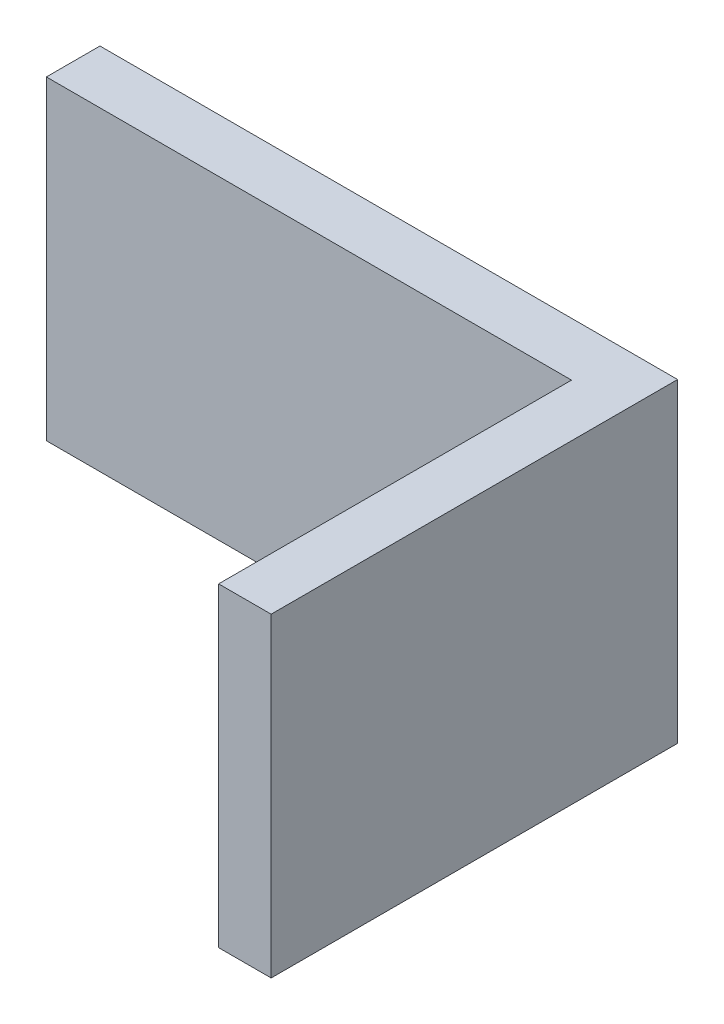
ISO-10303-21;
HEADER;
FILE_DESCRIPTION(('STEP AP214'),'2;1');
FILE_NAME('part.step','',(''),(''),'','','');
FILE_SCHEMA(('AUTOMOTIVE_DESIGN { 1 0 10303 214 1 1 1 1 }'));
ENDSEC;
DATA;
#1=APPLICATION_CONTEXT('core data for automotive mechanical design processes');
#2=APPLICATION_PROTOCOL_DEFINITION('international standard','automotive_design',2000,#1);
#3=PRODUCT_CONTEXT('',#1,'mechanical');
#4=PRODUCT('Part','Part','',(#3));
#5=PRODUCT_RELATED_PRODUCT_CATEGORY('part','',(#4));
#6=PRODUCT_DEFINITION_FORMATION('','',#4);
#7=PRODUCT_DEFINITION_CONTEXT('part definition',#1,'design');
#8=PRODUCT_DEFINITION('design','',#6,#7);
#9=PRODUCT_DEFINITION_SHAPE('','',#8);
#10=(LENGTH_UNIT() NAMED_UNIT(*) SI_UNIT(.MILLI.,.METRE.));
#11=(NAMED_UNIT(*) PLANE_ANGLE_UNIT() SI_UNIT($,.RADIAN.));
#12=(NAMED_UNIT(*) SI_UNIT($,.STERADIAN.) SOLID_ANGLE_UNIT());
#13=UNCERTAINTY_MEASURE_WITH_UNIT(LENGTH_MEASURE(1.E-05),#10,'distance_accuracy_value','');
#14=(GEOMETRIC_REPRESENTATION_CONTEXT(3) GLOBAL_UNCERTAINTY_ASSIGNED_CONTEXT((#13)) GLOBAL_UNIT_ASSIGNED_CONTEXT((#10,
#11,#12)) REPRESENTATION_CONTEXT('',''));
#15=CARTESIAN_POINT('',(0.,0.,0.));
#16=DIRECTION('',(0.,0.,1.));
#17=DIRECTION('',(1.,0.,0.));
#18=AXIS2_PLACEMENT_3D('',#15,#16,#17);
#19=CARTESIAN_POINT('',(4.55,1.9,0.));
#20=DIRECTION('',(0.,1.,0.));
#21=DIRECTION('',(0.,0.,1.));
#22=AXIS2_PLACEMENT_3D('',#19,#20,#21);
#23=PLANE('',#22);
#24=DIRECTION('',(1.,0.,0.));
#25=VECTOR('',#24,1.);
#26=CARTESIAN_POINT('',(4.,1.9,0.));
#27=LINE('',#26,#25);
#28=CARTESIAN_POINT('',(4.,1.9,0.));
#29=VERTEX_POINT('',#28);
#30=CARTESIAN_POINT('',(4.55,1.9,0.));
#31=VERTEX_POINT('',#30);
#32=EDGE_CURVE('E11',#29,#31,#27,.T.);
#33=ORIENTED_EDGE('',*,*,#32,.F.);
#34=DIRECTION('',(0.,0.,-1.));
#35=VECTOR('',#34,1.);
#36=CARTESIAN_POINT('',(4.,1.9,0.051));
#37=LINE('',#36,#35);
#38=CARTESIAN_POINT('',(4.,1.9,0.051));
#39=VERTEX_POINT('',#38);
#40=EDGE_CURVE('E24',#39,#29,#37,.T.);
#41=ORIENTED_EDGE('',*,*,#40,.F.);
#42=DIRECTION('',(-1.,0.,0.));
#43=VECTOR('',#42,1.);
#44=CARTESIAN_POINT('',(4.5,1.9,0.051));
#45=LINE('',#44,#43);
#46=CARTESIAN_POINT('',(4.5,1.9,0.051));
#47=VERTEX_POINT('',#46);
#48=EDGE_CURVE('E87',#47,#39,#45,.T.);
#49=ORIENTED_EDGE('',*,*,#48,.F.);
#50=DIRECTION('',(0.,0.,-1.));
#51=VECTOR('',#50,1.);
#52=CARTESIAN_POINT('',(4.5,1.9,0.387));
#53=LINE('',#52,#51);
#54=CARTESIAN_POINT('',(4.5,1.9,0.387));
#55=VERTEX_POINT('',#54);
#56=EDGE_CURVE('E114',#55,#47,#53,.T.);
#57=ORIENTED_EDGE('',*,*,#56,.F.);
#58=DIRECTION('',(-1.,0.,0.));
#59=VECTOR('',#58,1.);
#60=CARTESIAN_POINT('',(4.55,1.9,0.387));
#61=LINE('',#60,#59);
#62=CARTESIAN_POINT('',(4.55,1.9,0.387));
#63=VERTEX_POINT('',#62);
#64=EDGE_CURVE('E111',#63,#55,#61,.T.);
#65=ORIENTED_EDGE('',*,*,#64,.F.);
#66=DIRECTION('',(0.,0.,1.));
#67=VECTOR('',#66,1.);
#68=CARTESIAN_POINT('',(4.55,1.9,0.));
#69=LINE('',#68,#67);
#70=EDGE_CURVE('E108',#31,#63,#69,.T.);
#71=ORIENTED_EDGE('',*,*,#70,.F.);
#72=EDGE_LOOP('',(#33,#41,#49,#57,#65,#71));
#73=FACE_BOUND('',#72,.T.);
#74=ADVANCED_FACE('F17',(#73),#23,.T.);
#75=CARTESIAN_POINT('',(4.,1.6,0.));
#76=DIRECTION('',(0.,-1.,0.));
#77=DIRECTION('',(0.,0.,1.));
#78=AXIS2_PLACEMENT_3D('',#75,#76,#77);
#79=PLANE('',#78);
#80=DIRECTION('',(-1.,0.,0.));
#81=VECTOR('',#80,1.);
#82=CARTESIAN_POINT('',(4.55,1.6,0.));
#83=LINE('',#82,#81);
#84=CARTESIAN_POINT('',(4.55,1.6,0.));
#85=VERTEX_POINT('',#84);
#86=CARTESIAN_POINT('',(4.,1.6,0.));
#87=VERTEX_POINT('',#86);
#88=EDGE_CURVE('E106',#85,#87,#83,.T.);
#89=ORIENTED_EDGE('',*,*,#88,.F.);
#90=DIRECTION('',(0.,0.,-1.));
#91=VECTOR('',#90,1.);
#92=CARTESIAN_POINT('',(4.55,1.6,0.387));
#93=LINE('',#92,#91);
#94=CARTESIAN_POINT('',(4.55,1.6,0.387));
#95=VERTEX_POINT('',#94);
#96=EDGE_CURVE('E103',#95,#85,#93,.T.);
#97=ORIENTED_EDGE('',*,*,#96,.F.);
#98=DIRECTION('',(1.,0.,0.));
#99=VECTOR('',#98,1.);
#100=CARTESIAN_POINT('',(4.5,1.6,0.387));
#101=LINE('',#100,#99);
#102=CARTESIAN_POINT('',(4.5,1.6,0.387));
#103=VERTEX_POINT('',#102);
#104=EDGE_CURVE('E100',#103,#95,#101,.T.);
#105=ORIENTED_EDGE('',*,*,#104,.F.);
#106=DIRECTION('',(0.,0.,1.));
#107=VECTOR('',#106,1.);
#108=CARTESIAN_POINT('',(4.5,1.6,0.051));
#109=LINE('',#108,#107);
#110=CARTESIAN_POINT('',(4.5,1.6,0.051));
#111=VERTEX_POINT('',#110);
#112=EDGE_CURVE('E72',#111,#103,#109,.T.);
#113=ORIENTED_EDGE('',*,*,#112,.F.);
#114=DIRECTION('',(1.,0.,0.));
#115=VECTOR('',#114,1.);
#116=CARTESIAN_POINT('',(4.,1.6,0.051));
#117=LINE('',#116,#115);
#118=CARTESIAN_POINT('',(4.,1.6,0.051));
#119=VERTEX_POINT('',#118);
#120=EDGE_CURVE('E66',#119,#111,#117,.T.);
#121=ORIENTED_EDGE('',*,*,#120,.F.);
#122=DIRECTION('',(0.,0.,1.));
#123=VECTOR('',#122,1.);
#124=CARTESIAN_POINT('',(4.,1.6,0.));
#125=LINE('',#124,#123);
#126=EDGE_CURVE('E69',#87,#119,#125,.T.);
#127=ORIENTED_EDGE('',*,*,#126,.F.);
#128=EDGE_LOOP('',(#89,#97,#105,#113,#121,#127));
#129=FACE_BOUND('',#128,.T.);
#130=ADVANCED_FACE('F68',(#129),#79,.T.);
#131=CARTESIAN_POINT('',(4.55,1.9,0.387));
#132=DIRECTION('',(0.,0.,1.));
#133=DIRECTION('',(0.,1.,0.));
#134=AXIS2_PLACEMENT_3D('',#131,#132,#133);
#135=PLANE('',#134);
#136=ORIENTED_EDGE('',*,*,#64,.T.);
#137=DIRECTION('',(0.,1.,0.));
#138=VECTOR('',#137,1.);
#139=CARTESIAN_POINT('',(4.5,1.6,0.387));
#140=LINE('',#139,#138);
#141=EDGE_CURVE('E83',#103,#55,#140,.T.);
#142=ORIENTED_EDGE('',*,*,#141,.F.);
#143=ORIENTED_EDGE('',*,*,#104,.T.);
#144=DIRECTION('',(0.,-1.,0.));
#145=VECTOR('',#144,1.);
#146=CARTESIAN_POINT('',(4.55,1.9,0.387));
#147=LINE('',#146,#145);
#148=EDGE_CURVE('E88',#63,#95,#147,.T.);
#149=ORIENTED_EDGE('',*,*,#148,.F.);
#150=EDGE_LOOP('',(#136,#142,#143,#149));
#151=FACE_BOUND('',#150,.T.);
#152=ADVANCED_FACE('F125',(#151),#135,.T.);
#153=CARTESIAN_POINT('',(4.5,1.9,0.051));
#154=DIRECTION('',(0.,0.,1.));
#155=DIRECTION('',(0.,1.,0.));
#156=AXIS2_PLACEMENT_3D('',#153,#154,#155);
#157=PLANE('',#156);
#158=ORIENTED_EDGE('',*,*,#48,.T.);
#159=DIRECTION('',(0.,1.,0.));
#160=VECTOR('',#159,1.);
#161=CARTESIAN_POINT('',(4.,1.6,0.051));
#162=LINE('',#161,#160);
#163=EDGE_CURVE('E81',#119,#39,#162,.T.);
#164=ORIENTED_EDGE('',*,*,#163,.F.);
#165=ORIENTED_EDGE('',*,*,#120,.T.);
#166=DIRECTION('',(0.,-1.,0.));
#167=VECTOR('',#166,1.);
#168=CARTESIAN_POINT('',(4.5,1.9,0.051));
#169=LINE('',#168,#167);
#170=EDGE_CURVE('E89',#47,#111,#169,.T.);
#171=ORIENTED_EDGE('',*,*,#170,.F.);
#172=EDGE_LOOP('',(#158,#164,#165,#171));
#173=FACE_BOUND('',#172,.T.);
#174=ADVANCED_FACE('F86',(#173),#157,.T.);
#175=CARTESIAN_POINT('',(4.55,1.6,0.));
#176=DIRECTION('',(1.,0.,0.));
#177=DIRECTION('',(0.,0.,1.));
#178=AXIS2_PLACEMENT_3D('',#175,#176,#177);
#179=PLANE('',#178);
#180=DIRECTION('',(0.,-1.,0.));
#181=VECTOR('',#180,1.);
#182=CARTESIAN_POINT('',(4.55,1.9,0.));
#183=LINE('',#182,#181);
#184=EDGE_CURVE('E93',#31,#85,#183,.T.);
#185=ORIENTED_EDGE('',*,*,#184,.F.);
#186=ORIENTED_EDGE('',*,*,#70,.T.);
#187=ORIENTED_EDGE('',*,*,#148,.T.);
#188=ORIENTED_EDGE('',*,*,#96,.T.);
#189=EDGE_LOOP('',(#185,#186,#187,#188));
#190=FACE_BOUND('',#189,.T.);
#191=ADVANCED_FACE('F121',(#190),#179,.T.);
#192=CARTESIAN_POINT('',(4.,1.9,0.));
#193=DIRECTION('',(-1.,0.,0.));
#194=DIRECTION('',(0.,0.,1.));
#195=AXIS2_PLACEMENT_3D('',#192,#193,#194);
#196=PLANE('',#195);
#197=DIRECTION('',(0.,1.,0.));
#198=VECTOR('',#197,1.);
#199=CARTESIAN_POINT('',(4.,1.6,0.));
#200=LINE('',#199,#198);
#201=EDGE_CURVE('E82',#87,#29,#200,.T.);
#202=ORIENTED_EDGE('',*,*,#201,.F.);
#203=ORIENTED_EDGE('',*,*,#126,.T.);
#204=ORIENTED_EDGE('',*,*,#163,.T.);
#205=ORIENTED_EDGE('',*,*,#40,.T.);
#206=EDGE_LOOP('',(#202,#203,#204,#205));
#207=FACE_BOUND('',#206,.T.);
#208=ADVANCED_FACE('F80',(#207),#196,.T.);
#209=CARTESIAN_POINT('',(4.5,1.9,0.051));
#210=DIRECTION('',(-1.,0.,0.));
#211=DIRECTION('',(0.,0.,1.));
#212=AXIS2_PLACEMENT_3D('',#209,#210,#211);
#213=PLANE('',#212);
#214=ORIENTED_EDGE('',*,*,#170,.T.);
#215=ORIENTED_EDGE('',*,*,#112,.T.);
#216=ORIENTED_EDGE('',*,*,#141,.T.);
#217=ORIENTED_EDGE('',*,*,#56,.T.);
#218=EDGE_LOOP('',(#214,#215,#216,#217));
#219=FACE_BOUND('',#218,.T.);
#220=ADVANCED_FACE('F127',(#219),#213,.T.);
#221=CARTESIAN_POINT('',(4.55,1.6,0.));
#222=DIRECTION('',(0.,0.,-1.));
#223=DIRECTION('',(0.,1.,0.));
#224=AXIS2_PLACEMENT_3D('',#221,#222,#223);
#225=PLANE('',#224);
#226=ORIENTED_EDGE('',*,*,#88,.T.);
#227=ORIENTED_EDGE('',*,*,#201,.T.);
#228=ORIENTED_EDGE('',*,*,#32,.T.);
#229=ORIENTED_EDGE('',*,*,#184,.T.);
#230=EDGE_LOOP('',(#226,#227,#228,#229));
#231=FACE_BOUND('',#230,.T.);
#232=ADVANCED_FACE('F117',(#231),#225,.T.);
#233=CLOSED_SHELL('',(#74,#130,#152,#174,#191,#208,#220,#232));
#234=MANIFOLD_SOLID_BREP('B1',#233);
#235=ADVANCED_BREP_SHAPE_REPRESENTATION('',(#18,#234),#14);
#236=SHAPE_DEFINITION_REPRESENTATION(#9,#235);
ENDSEC;
END-ISO-10303-21;
